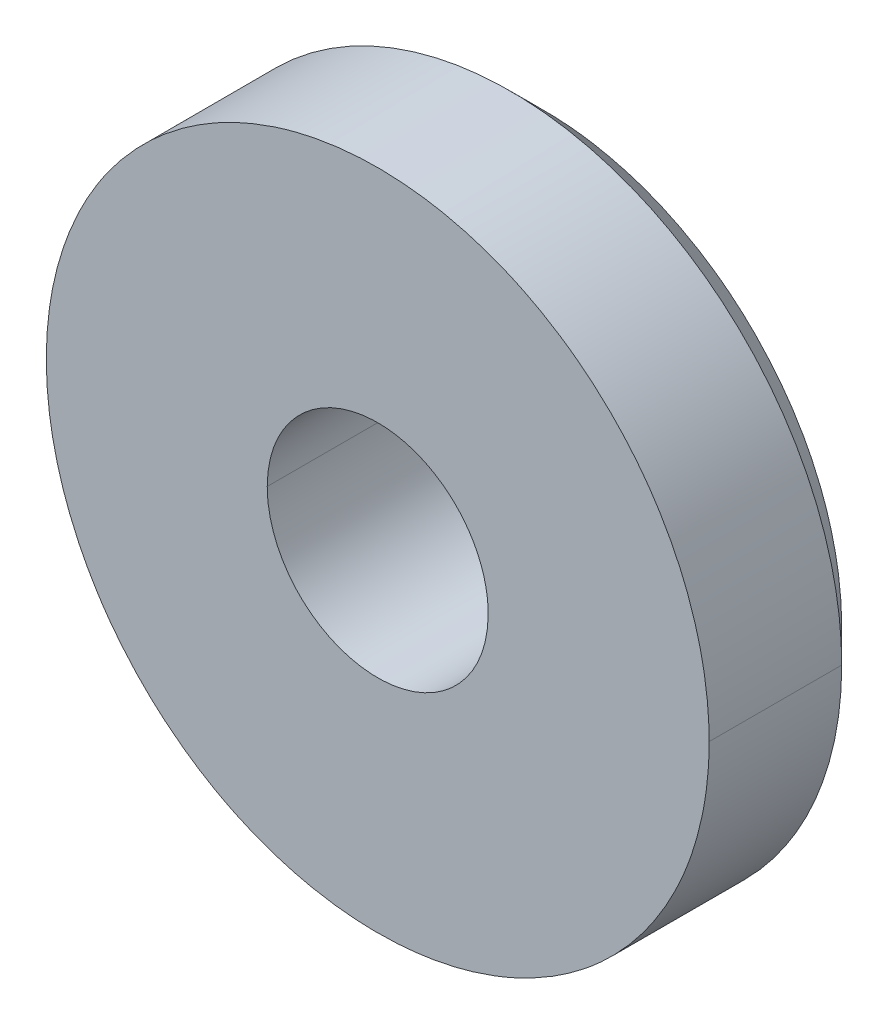
ISO-10303-21;
HEADER;
FILE_DESCRIPTION(('STEP AP214'),'2;1');
FILE_NAME('part.step','',(''),(''),'','','');
FILE_SCHEMA(('AUTOMOTIVE_DESIGN { 1 0 10303 214 1 1 1 1 }'));
ENDSEC;
DATA;
#1=APPLICATION_CONTEXT('core data for automotive mechanical design processes');
#2=APPLICATION_PROTOCOL_DEFINITION('international standard','automotive_design',2000,#1);
#3=PRODUCT_CONTEXT('',#1,'mechanical');
#4=PRODUCT('Part','Part','',(#3));
#5=PRODUCT_RELATED_PRODUCT_CATEGORY('part','',(#4));
#6=PRODUCT_DEFINITION_FORMATION('','',#4);
#7=PRODUCT_DEFINITION_CONTEXT('part definition',#1,'design');
#8=PRODUCT_DEFINITION('design','',#6,#7);
#9=PRODUCT_DEFINITION_SHAPE('','',#8);
#10=(LENGTH_UNIT() NAMED_UNIT(*) SI_UNIT(.MILLI.,.METRE.));
#11=(NAMED_UNIT(*) PLANE_ANGLE_UNIT() SI_UNIT($,.RADIAN.));
#12=(NAMED_UNIT(*) SI_UNIT($,.STERADIAN.) SOLID_ANGLE_UNIT());
#13=UNCERTAINTY_MEASURE_WITH_UNIT(LENGTH_MEASURE(1.E-05),#10,'distance_accuracy_value','');
#14=(GEOMETRIC_REPRESENTATION_CONTEXT(3) GLOBAL_UNCERTAINTY_ASSIGNED_CONTEXT((#13)) GLOBAL_UNIT_ASSIGNED_CONTEXT((#10,
#11,#12)) REPRESENTATION_CONTEXT('',''));
#15=CARTESIAN_POINT('',(0.,0.,0.));
#16=DIRECTION('',(0.,0.,1.));
#17=DIRECTION('',(1.,0.,0.));
#18=AXIS2_PLACEMENT_3D('',#15,#16,#17);
#19=CARTESIAN_POINT('',(0.741607202149,-10.1523636274,3.85520000018));
#20=CARTESIAN_POINT('',(0.741607202149,-10.1523636274,4.148));
#21=CARTESIAN_POINT('',(0.741607202149,-9.92239904514,3.85520000018));
#22=CARTESIAN_POINT('',(0.741607202149,-9.92239904514,4.148));
#23=CARTESIAN_POINT('',(0.651560219188,-9.69221990444,3.85520000018));
#24=CARTESIAN_POINT('',(0.651560219188,-9.69221990444,4.148));
#25=CARTESIAN_POINT('',(0.469536366635,-9.51041061034,3.85520000018));
#26=CARTESIAN_POINT('',(0.469536366635,-9.51041061034,4.148));
#27=CARTESIAN_POINT('',(0.0096072021492,-9.33031664442,3.85520000018));
#28=CARTESIAN_POINT('',(0.0096072021492,-9.33031664442,4.148));
#29=CARTESIAN_POINT('',(-0.450321962336,-9.51041061034,3.85520000018));
#30=CARTESIAN_POINT('',(-0.450321962336,-9.51041061034,4.148));
#31=CARTESIAN_POINT('',(-0.632345814889,-9.69221990444,3.85520000018));
#32=CARTESIAN_POINT('',(-0.632345814889,-9.69221990444,4.148));
#33=CARTESIAN_POINT('',(-0.722392797851,-9.92239904514,3.85520000018));
#34=CARTESIAN_POINT('',(-0.722392797851,-9.92239904514,4.148));
#35=CARTESIAN_POINT('',(-0.722392797851,-10.1523636274,3.85520000018));
#36=CARTESIAN_POINT('',(-0.722392797851,-10.1523636274,4.148));
#37=B_SPLINE_SURFACE_WITH_KNOTS('',5,1,((#19,#20),(#21,#22),(#23,#24),(#25,#26),(#27,#28),(#29,
#30),(#31,#32),(#33,#34),(#35,#36)),.UNSPECIFIED.,.F.,.F.,.F.,(6,3,6),(2,2),(0.,4.71238898038,
9.42477796077),(0.300000000745,1.5),.UNSPECIFIED.);
#38=DIRECTION('',(0.,0.,1.));
#39=VECTOR('',#38,1.);
#40=CARTESIAN_POINT('',(-0.722392797851,-10.1523636274,4.00160000009));
#41=LINE('',#40,#39);
#42=CARTESIAN_POINT('',(-0.722392797851,-10.1523636274,3.855200000045));
#43=VERTEX_POINT('',#42);
#44=CARTESIAN_POINT('',(-0.722392797851,-10.1523636274,4.148));
#45=VERTEX_POINT('',#44);
#46=EDGE_CURVE('E75',#43,#45,#41,.T.);
#47=CARTESIAN_POINT('',(-0.722392797851,-10.1523636274,4.148));
#48=CARTESIAN_POINT('',(-0.722432423499187,-10.1111685273464,4.148));
#49=CARTESIAN_POINT('',(-0.718927404655226,-10.0699817403168,4.148));
#50=CARTESIAN_POINT('',(-0.705079684813569,-9.98880846107538,4.148));
#51=CARTESIAN_POINT('',(-0.694742736725961,-9.9488209885561,4.148));
#52=CARTESIAN_POINT('',(-0.667485595560483,-9.87116709534559,4.148));
#53=CARTESIAN_POINT('',(-0.650567139432428,-9.83350006529359,4.148));
#54=CARTESIAN_POINT('',(-0.61065456072932,-9.76154763979671,4.148));
#55=CARTESIAN_POINT('',(-0.587661674176344,-9.72726155834494,4.148));
#56=CARTESIAN_POINT('',(-0.536248146104297,-9.66301662065583,4.148));
#57=CARTESIAN_POINT('',(-0.507825779798539,-9.63305914481557,4.148));
#58=CARTESIAN_POINT('',(-0.446363458581145,-9.57832971433559,4.148));
#59=CARTESIAN_POINT('',(-0.413323584855613,-9.55355766854354,4.148));
#60=CARTESIAN_POINT('',(-0.343476258670869,-9.50985461634751,4.148));
#61=CARTESIAN_POINT('',(-0.306660020902168,-9.49093766121748,4.148));
#62=CARTESIAN_POINT('',(-0.230396748521862,-9.45959321678437,4.148));
#63=CARTESIAN_POINT('',(-0.190952822648428,-9.44715820742077,4.148));
#64=CARTESIAN_POINT('',(-0.124005993842673,-9.43212328628082,4.148));
#65=CARTESIAN_POINT('',(-0.0969139330411425,-9.42762576465929,4.148));
#66=CARTESIAN_POINT('',(-0.0423953098154197,-9.42169455400499,4.148));
#67=CARTESIAN_POINT('',(-0.0149687283796831,-9.42026103993018,4.148));
#68=CARTESIAN_POINT('',(0.0535928354110576,-9.4205313259659,4.148));
#69=CARTESIAN_POINT('',(0.0947351449589279,-9.42415890175526,4.148));
#70=CARTESIAN_POINT('',(0.175852167422075,-9.43828501511646,4.148));
#71=CARTESIAN_POINT('',(0.215825679402244,-9.4487903771589,4.148));
#72=CARTESIAN_POINT('',(0.293357044025869,-9.47634868821114,4.148));
#73=CARTESIAN_POINT('',(0.33091975023955,-9.49338796710421,4.148));
#74=CARTESIAN_POINT('',(0.402717423279223,-9.53355667018007,4.148));
#75=CARTESIAN_POINT('',(0.436946563630724,-9.55669650441231,4.148));
#76=CARTESIAN_POINT('',(0.501057064632766,-9.60840024155609,4.148));
#77=CARTESIAN_POINT('',(0.530936193886822,-9.63696691104007,4.148));
#78=CARTESIAN_POINT('',(0.585433562374645,-9.69865535399853,4.148));
#79=CARTESIAN_POINT('',(0.610060669435483,-9.73176929162176,4.148));
#80=CARTESIAN_POINT('',(0.653472181414884,-9.80174823565215,4.148));
#81=CARTESIAN_POINT('',(0.672240773939987,-9.83862304337055,4.148));
#82=CARTESIAN_POINT('',(0.703292191130568,-9.91500170549565,4.148));
#83=CARTESIAN_POINT('',(0.715578555789208,-9.95450411165013,4.148));
#84=CARTESIAN_POINT('',(0.730157102628293,-10.0206156460551,4.148));
#85=CARTESIAN_POINT('',(0.734450708643157,-10.0468007842673,4.148));
#86=CARTESIAN_POINT('',(0.74017542949504,-10.0994416858263,4.148));
#87=CARTESIAN_POINT('',(0.741610903978342,-10.12589697504,4.148));
#88=CARTESIAN_POINT('',(0.741607202149,-10.1523636272,4.148));
#89=B_SPLINE_CURVE_WITH_KNOTS('',3,(#47,#48,#49,#50,#51,#52,#53,#54,#55,#56,#57,#58,#59,#60,#61,
#62,#63,#64,#65,#66,#67,#68,#69,#70,#71,#72,#73,#74,#75,#76,#77,#78,#79,#80,#81,#82,#83,#84,#85,
#86,#87,#88),.UNSPECIFIED.,.F.,.F.,(4,2,2,2,2,2,2,2,2,2,2,2,2,2,2,2,2,2,2,2,4),(0.,
0.123423883478034,0.246743968545604,0.370031529814897,0.493294023888686,0.616595740159022,
0.739895288782198,0.863488482376534,0.986937967800939,1.0691644334498,1.15139559418847,
1.27468367458818,1.39809427314119,1.52124807119916,1.64461339585898,1.7680417811166,
1.89126008297913,2.01480813698982,2.13828865046214,2.21774840994021,2.29708687246489),.UNSPECIFIED.);
#90=CARTESIAN_POINT('',(0.741607202149,-10.1523636273,4.148));
#91=VERTEX_POINT('',#90);
#92=EDGE_CURVE('E23',#45,#91,#89,.T.);
#93=DIRECTION('',(0.,0.,-1.));
#94=VECTOR('',#93,1.);
#95=CARTESIAN_POINT('',(0.741607202149,-10.1523636274,4.00160000009));
#96=LINE('',#95,#94);
#97=CARTESIAN_POINT('',(0.741607202149,-10.1523636274,3.855200000045));
#98=VERTEX_POINT('',#97);
#99=EDGE_CURVE('E65',#91,#98,#96,.T.);
#100=CARTESIAN_POINT('',(0.741607202149,-10.1523636274,3.8552));
#101=CARTESIAN_POINT('',(0.741607202149,-9.92239904514,3.8552));
#102=CARTESIAN_POINT('',(0.651560219188,-9.69221990444,3.8552));
#103=CARTESIAN_POINT('',(0.469536366635,-9.51041061034,3.8552));
#104=CARTESIAN_POINT('',(0.0096072021492,-9.33031664442,3.8552));
#105=CARTESIAN_POINT('',(-0.450321962336,-9.51041061034,3.8552));
#106=CARTESIAN_POINT('',(-0.632345814889,-9.69221990444,3.8552));
#107=CARTESIAN_POINT('',(-0.722392797851,-9.92239904514,3.8552));
#108=CARTESIAN_POINT('',(-0.722392797851,-10.1523636274,3.8552));
#109=B_SPLINE_CURVE_WITH_KNOTS('',5,(#100,#101,#102,#103,#104,#105,#106,#107,#108),
.UNSPECIFIED.,.F.,.F.,(6,3,6),(0.,157.079632679,314.159265359),.UNSPECIFIED.);
#110=EDGE_CURVE('E74',#43,#98,#109,.F.);
#111=ORIENTED_EDGE('',*,*,#46,.T.);
#112=ORIENTED_EDGE('',*,*,#92,.T.);
#113=ORIENTED_EDGE('',*,*,#99,.T.);
#114=ORIENTED_EDGE('',*,*,#110,.F.);
#115=EDGE_LOOP('',(#111,#112,#113,#114));
#116=FACE_BOUND('',#115,.T.);
#117=ADVANCED_FACE('F16',(#116),#37,.T.);
#118=CARTESIAN_POINT('',(0.668407202149,-10.1523636274,3.782));
#119=CARTESIAN_POINT('',(0.741607202149,-10.1523636274,3.8552));
#120=CARTESIAN_POINT('',(0.668407202149,-9.94539550336,3.782));
#121=CARTESIAN_POINT('',(0.741607202149,-9.92239904514,3.8552));
#122=CARTESIAN_POINT('',(0.587364917484,-9.73823427673,3.782));
#123=CARTESIAN_POINT('',(0.651560219188,-9.69221990444,3.8552));
#124=CARTESIAN_POINT('',(0.423543450186,-9.57460591205,3.782));
#125=CARTESIAN_POINT('',(0.469536366635,-9.51041061034,3.8552));
#126=CARTESIAN_POINT('',(0.0096072021492,-9.41252134272,3.782));
#127=CARTESIAN_POINT('',(0.0096072021492,-9.33031664442,3.8552));
#128=CARTESIAN_POINT('',(-0.404329045888,-9.57460591205,3.782));
#129=CARTESIAN_POINT('',(-0.450321962336,-9.51041061034,3.8552));
#130=CARTESIAN_POINT('',(-0.568150513185,-9.73823427673,3.782));
#131=CARTESIAN_POINT('',(-0.632345814889,-9.69221990444,3.8552));
#132=CARTESIAN_POINT('',(-0.649192797851,-9.94539550336,3.782));
#133=CARTESIAN_POINT('',(-0.722392797851,-9.92239904514,3.8552));
#134=CARTESIAN_POINT('',(-0.649192797851,-10.1523636274,3.782));
#135=CARTESIAN_POINT('',(-0.722392797851,-10.1523636274,3.8552));
#136=B_SPLINE_SURFACE_WITH_KNOTS('',5,1,((#118,#119),(#120,#121),(#122,#123),(#124,#125),(#126,
#127),(#128,#129),(#130,#131),(#132,#133),(#134,#135)),.UNSPECIFIED.,.F.,.F.,.F.,(6,3,6),(2,2),
(0.,157.079632679,314.159265359),(-0.212132034356,0.212132034356),.UNSPECIFIED.);
#137=DIRECTION('',(0.707106781186549,0.,0.707106781186546));
#138=VECTOR('',#137,1.);
#139=CARTESIAN_POINT('',(0.705007202149,-10.1523636274,3.8186));
#140=LINE('',#139,#138);
#141=CARTESIAN_POINT('',(0.668407202149,-10.1523636274,3.782));
#142=VERTEX_POINT('',#141);
#143=EDGE_CURVE('E237',#142,#98,#140,.T.);
#144=CARTESIAN_POINT('',(0.668407202149,-10.1523636274,3.782));
#145=CARTESIAN_POINT('',(0.6684428900144,-10.1152761522206,3.782));
#146=CARTESIAN_POINT('',(0.665286344951107,-10.0781962178984,3.782));
#147=CARTESIAN_POINT('',(0.652815499437408,-10.0051177990971,3.782));
#148=CARTESIAN_POINT('',(0.643506408814306,-9.96911842656298,3.782));
#149=CARTESIAN_POINT('',(0.618950019794749,-9.89918284358384,3.782));
#150=CARTESIAN_POINT('',(0.603699593911601,-9.86524773064894,3.782));
#151=CARTESIAN_POINT('',(0.567718635541626,-9.80042790785306,3.782));
#152=CARTESIAN_POINT('',(0.546988976881086,-9.76954271267004,3.782));
#153=CARTESIAN_POINT('',(0.500662658260428,-9.71171255247884,3.782));
#154=CARTESIAN_POINT('',(0.475070226714507,-9.68476419994388,3.782));
#155=CARTESIAN_POINT('',(0.419730800218386,-9.63553425981047,3.782));
#156=CARTESIAN_POINT('',(0.389983561505038,-9.61325294621974,3.782));
#157=CARTESIAN_POINT('',(0.327115637227163,-9.57396068374474,3.782));
#158=CARTESIAN_POINT('',(0.293988985513177,-9.55695927786246,3.782));
#159=CARTESIAN_POINT('',(0.225348239578179,-9.5287771022224,3.782));
#160=CARTESIAN_POINT('',(0.189834337528331,-9.51759586457921,3.782));
#161=CARTESIAN_POINT('',(0.117521048217636,-9.50139728561173,3.782));
#162=CARTESIAN_POINT('',(0.0807250580271895,-9.49636476570743,3.782));
#163=CARTESIAN_POINT('',(0.006812015063087,-9.49253102618693,3.782));
#164=CARTESIAN_POINT('',(-0.0303050243898824,-9.4937295492643,3.782));
#165=CARTESIAN_POINT('',(-0.103869372253559,-9.50234183068112,3.782));
#166=CARTESIAN_POINT('',(-0.14031557984277,-9.50976501018872,3.782));
#167=CARTESIAN_POINT('',(-0.211436929676845,-9.53063977631524,3.782));
#168=CARTESIAN_POINT('',(-0.246112150375978,-9.54409109563061,3.782));
#169=CARTESIAN_POINT('',(-0.312647128715574,-9.57659944642767,3.782));
#170=CARTESIAN_POINT('',(-0.344511919334176,-9.5956461811299,3.782));
#171=CARTESIAN_POINT('',(-0.404601883771334,-9.63880639533054,3.782));
#172=CARTESIAN_POINT('',(-0.432827039915595,-9.66291989943201,3.782));
#173=CARTESIAN_POINT('',(-0.484904830484827,-9.71559104672248,3.782));
#174=CARTESIAN_POINT('',(-0.508747189032719,-9.74415885100378,3.782));
#175=CARTESIAN_POINT('',(-0.551296794487451,-9.80489218834482,3.782));
#176=CARTESIAN_POINT('',(-0.570004158242076,-9.83705763951597,3.782));
#177=CARTESIAN_POINT('',(-0.601754982220326,-9.90409728348879,3.782));
#178=CARTESIAN_POINT('',(-0.614794606903192,-9.93897329185449,3.782));
#179=CARTESIAN_POINT('',(-0.634790555582025,-10.0103797204443,3.782));
#180=CARTESIAN_POINT('',(-0.641756108745536,-10.0469075416919,3.782));
#181=CARTESIAN_POINT('',(-0.648004671157885,-10.1065411375124,3.782));
#182=CARTESIAN_POINT('',(-0.649203518673693,-10.1294588083198,3.782));
#183=CARTESIAN_POINT('',(-0.649192797851,-10.1523636274,3.782));
#184=B_SPLINE_CURVE_WITH_KNOTS('',3,(#144,#145,#146,#147,#148,#149,#150,#151,#152,#153,#154,
#155,#156,#157,#158,#159,#160,#161,#162,#163,#164,#165,#166,#167,#168,#169,#170,#171,#172,#173,
#174,#175,#176,#177,#178,#179,#180,#181,#182,#183),.UNSPECIFIED.,.F.,.F.,(4,2,2,2,2,2,2,2,2,2,2,
2,2,2,2,2,2,2,2,4),(0.,0.111116908860868,0.222139846945482,0.33322130604029,0.444285060577122,
0.555252678194433,0.666226809035167,0.777400364653236,0.888564981608372,0.999454622118593,
1.11033968355752,1.22139287577614,1.33244114409194,1.44328632605838,1.55413204627575,
1.66523442908698,1.77633428353271,1.88750920619556,1.99851490977315,2.06723138042201),.UNSPECIFIED.);
#185=CARTESIAN_POINT('',(-0.649192797851,-10.1523636274,3.782));
#186=VERTEX_POINT('',#185);
#187=EDGE_CURVE('E153',#142,#186,#184,.T.);
#188=DIRECTION('',(0.707106781186548,0.,-0.707106781186547));
#189=VECTOR('',#188,1.);
#190=CARTESIAN_POINT('',(-0.685792797851,-10.1523636274,3.8186));
#191=LINE('',#190,#189);
#192=EDGE_CURVE('E235',#43,#186,#191,.T.);
#193=ORIENTED_EDGE('',*,*,#143,.F.);
#194=ORIENTED_EDGE('',*,*,#187,.T.);
#195=ORIENTED_EDGE('',*,*,#192,.F.);
#196=ORIENTED_EDGE('',*,*,#110,.T.);
#197=EDGE_LOOP('',(#193,#194,#195,#196));
#198=FACE_BOUND('',#197,.T.);
#199=ADVANCED_FACE('F162',(#198),#136,.T.);
#200=CARTESIAN_POINT('',(-0.649192797851,-10.1523636274,3.782));
#201=CARTESIAN_POINT('',(-0.722392797851,-10.1523636274,3.8552));
#202=CARTESIAN_POINT('',(-0.649192797851,-10.3593317514,3.782));
#203=CARTESIAN_POINT('',(-0.722392797851,-10.3823282096,3.8552));
#204=CARTESIAN_POINT('',(-0.568150513185,-10.566492978,3.782));
#205=CARTESIAN_POINT('',(-0.63234581489,-10.6125073503,3.8552));
#206=CARTESIAN_POINT('',(-0.404329045888,-10.7301213427,3.782));
#207=CARTESIAN_POINT('',(-0.450321962337,-10.7943166444,3.8552));
#208=CARTESIAN_POINT('',(0.0096072021492,-10.892205912,3.782));
#209=CARTESIAN_POINT('',(0.0096072021492,-10.9744106103,3.8552));
#210=CARTESIAN_POINT('',(0.423543450186,-10.7301213427,3.782));
#211=CARTESIAN_POINT('',(0.469536366635,-10.7943166444,3.8552));
#212=CARTESIAN_POINT('',(0.587364917484,-10.566492978,3.782));
#213=CARTESIAN_POINT('',(0.651560219188,-10.6125073503,3.8552));
#214=CARTESIAN_POINT('',(0.668407202149,-10.3593317514,3.782));
#215=CARTESIAN_POINT('',(0.741607202149,-10.3823282096,3.8552));
#216=CARTESIAN_POINT('',(0.668407202149,-10.1523636274,3.782));
#217=CARTESIAN_POINT('',(0.741607202149,-10.1523636274,3.8552));
#218=B_SPLINE_SURFACE_WITH_KNOTS('',5,1,((#200,#201),(#202,#203),(#204,#205),(#206,#207),(#208,
#209),(#210,#211),(#212,#213),(#214,#215),(#216,#217)),.UNSPECIFIED.,.F.,.F.,.F.,(6,3,6),(2,2),
(314.159265359,471.238898038,628.318530718),(-0.212132034358,0.212132034358),.UNSPECIFIED.);
#219=CARTESIAN_POINT('',(-0.649192797851,-10.1523636274,3.782));
#220=CARTESIAN_POINT('',(-0.6492284857164,-10.1894511025667,3.782));
#221=CARTESIAN_POINT('',(-0.646071940653986,-10.2265310368761,3.782));
#222=CARTESIAN_POINT('',(-0.63360109514461,-10.2996094556519,3.782));
#223=CARTESIAN_POINT('',(-0.624292004525008,-10.3356088281733,3.782));
#224=CARTESIAN_POINT('',(-0.599735615515911,-10.405544411128,3.782));
#225=CARTESIAN_POINT('',(-0.584485189639767,-10.4394795240513,3.782));
#226=CARTESIAN_POINT('',(-0.548504231287397,-10.5042993468265,3.782));
#227=CARTESIAN_POINT('',(-0.527774572637429,-10.5351845420005,3.782));
#228=CARTESIAN_POINT('',(-0.481448254033629,-10.5930147021865,3.782));
#229=CARTESIAN_POINT('',(-0.455855822492433,-10.6199630547241,3.782));
#230=CARTESIAN_POINT('',(-0.400516396005512,-10.6691929948637,3.782));
#231=CARTESIAN_POINT('',(-0.370769157296638,-10.6914743084582,3.782));
#232=CARTESIAN_POINT('',(-0.307901233025173,-10.7307665709426,3.782));
#233=CARTESIAN_POINT('',(-0.274774581312919,-10.7477679768303,3.782));
#234=CARTESIAN_POINT('',(-0.206133835380323,-10.7759501524812,3.782));
#235=CARTESIAN_POINT('',(-0.170619933331146,-10.7871313901297,3.782));
#236=CARTESIAN_POINT('',(-0.0983066440226275,-10.8033299691072,3.782));
#237=CARTESIAN_POINT('',(-0.0615106538337555,-10.8083624890166,3.782));
#238=CARTESIAN_POINT('',(0.0124023891280993,-10.8121962285484,3.782));
#239=CARTESIAN_POINT('',(0.0495194285803958,-10.8109977054773,3.782));
#240=CARTESIAN_POINT('',(0.123083776448448,-10.8023854240733,3.782));
#241=CARTESIAN_POINT('',(0.159529984042621,-10.7949622445714,3.782));
#242=CARTESIAN_POINT('',(0.230651333887172,-10.7740874784546,3.782));
#243=CARTESIAN_POINT('',(0.265326554591821,-10.7606361591433,3.782));
#244=CARTESIAN_POINT('',(0.331861532939316,-10.7281278083544,3.782));
#245=CARTESIAN_POINT('',(0.363726323560573,-10.7090810736567,3.782));
#246=CARTESIAN_POINT('',(0.423816288003856,-10.6659208594648,3.782));
#247=CARTESIAN_POINT('',(0.452041444151581,-10.6418073553675,3.782));
#248=CARTESIAN_POINT('',(0.504119234728751,-10.5891362080845,3.782));
#249=CARTESIAN_POINT('',(0.527961593281087,-10.5605684038067,3.782));
#250=CARTESIAN_POINT('',(0.570511198745282,-10.4998350664717,3.782));
#251=CARTESIAN_POINT('',(0.589218562504928,-10.4676696153032,3.782));
#252=CARTESIAN_POINT('',(0.620969386493298,-10.4006299713345,3.782));
#253=CARTESIAN_POINT('',(0.634009011181236,-10.3657539629702,3.782));
#254=CARTESIAN_POINT('',(0.654004959869073,-10.2943475343822,3.782));
#255=CARTESIAN_POINT('',(0.66097051303653,-10.2578197131348,3.782));
#256=CARTESIAN_POINT('',(0.66721907545451,-10.1981861173056,3.782));
#257=CARTESIAN_POINT('',(0.668417922971729,-10.1752684464892,3.782));
#258=CARTESIAN_POINT('',(0.668407202149,-10.1523636274,3.782));
#259=B_SPLINE_CURVE_WITH_KNOTS('',3,(#219,#220,#221,#222,#223,#224,#225,#226,#227,#228,#229,
#230,#231,#232,#233,#234,#235,#236,#237,#238,#239,#240,#241,#242,#243,#244,#245,#246,#247,#248,
#249,#250,#251,#252,#253,#254,#255,#256,#257,#258),.UNSPECIFIED.,.F.,.F.,(4,2,2,2,2,2,2,2,2,2,2,
2,2,2,2,2,2,2,2,4),(0.,0.111116908822671,0.222139846868064,0.333221305922811,0.444285060420128,
0.555252678033383,0.666226808870091,0.777400364490926,0.88856498144886,0.999454621956558,
1.11033968339307,1.22139287562271,1.33244114394932,1.44328632591551,1.5541320461328,
1.66523442894472,1.77633428339107,1.88750920605511,1.99851490963368,2.06723138030945),.UNSPECIFIED.);
#260=EDGE_CURVE('E158',#186,#142,#259,.T.);
#261=CARTESIAN_POINT('',(-0.722392797851,-10.1523636274,3.8552));
#262=CARTESIAN_POINT('',(-0.722392797851,-10.3823282096,3.8552));
#263=CARTESIAN_POINT('',(-0.632345814889,-10.6125073503,3.8552));
#264=CARTESIAN_POINT('',(-0.450321962336,-10.7943166444,3.8552));
#265=CARTESIAN_POINT('',(0.0096072021492,-10.9744106103,3.8552));
#266=CARTESIAN_POINT('',(0.469536366635,-10.7943166444,3.8552));
#267=CARTESIAN_POINT('',(0.651560219188,-10.6125073503,3.8552));
#268=CARTESIAN_POINT('',(0.741607202149,-10.3823282096,3.8552));
#269=CARTESIAN_POINT('',(0.741607202149,-10.1523636274,3.8552));
#270=B_SPLINE_CURVE_WITH_KNOTS('',5,(#261,#262,#263,#264,#265,#266,#267,#268,#269),
.UNSPECIFIED.,.F.,.F.,(6,3,6),(9.42477796077,14.1371669412,18.8495559215),.UNSPECIFIED.);
#271=EDGE_CURVE('E152',#43,#98,#270,.T.);
#272=ORIENTED_EDGE('',*,*,#192,.T.);
#273=ORIENTED_EDGE('',*,*,#260,.T.);
#274=ORIENTED_EDGE('',*,*,#143,.T.);
#275=ORIENTED_EDGE('',*,*,#271,.F.);
#276=EDGE_LOOP('',(#272,#273,#274,#275));
#277=FACE_BOUND('',#276,.T.);
#278=ADVANCED_FACE('F125',(#277),#218,.T.);
#279=CARTESIAN_POINT('',(0.0096072021492,-10.1523636274,3.782));
#280=DIRECTION('',(0.,0.,1.));
#281=DIRECTION('',(1.,0.,0.));
#282=AXIS2_PLACEMENT_3D('',#279,#280,#281);
#283=PLANE('',#282);
#284=CARTESIAN_POINT('',(-0.234392797851,-10.1523636274,3.782));
#285=CARTESIAN_POINT('',(-0.234404818173571,-10.1660826772365,3.782));
#286=CARTESIAN_POINT('',(-0.233239339639963,-10.1797979364527,3.782));
#287=CARTESIAN_POINT('',(-0.228633515229728,-10.2068294472002,3.782));
#288=CARTESIAN_POINT('',(-0.225195091379917,-10.2201460259237,3.782));
#289=CARTESIAN_POINT('',(-0.216120883490512,-10.246019984594,3.782));
#290=CARTESIAN_POINT('',(-0.210483948433885,-10.2585769628725,3.782));
#291=CARTESIAN_POINT('',(-0.197198425807195,-10.2825572970578,3.782));
#292=CARTESIAN_POINT('',(-0.189550149006834,-10.2939808277169,3.782));
#293=CARTESIAN_POINT('',(-0.163872380158643,-10.3260635730651,3.782));
#294=CARTESIAN_POINT('',(-0.143079757185359,-10.3446189243436,3.782));
#295=CARTESIAN_POINT('',(-0.0965226206246826,-10.3737890269783,3.782));
#296=CARTESIAN_POINT('',(-0.0707494099594805,-10.3843897274935,3.782));
#297=CARTESIAN_POINT('',(-0.0172040678570755,-10.39643450593,3.782));
#298=CARTESIAN_POINT('',(0.0105629089831653,-10.3979013929482,3.782));
#299=CARTESIAN_POINT('',(0.0650589685371467,-10.3915602534089,3.782));
#300=CARTESIAN_POINT('',(0.0917865036111241,-10.3837389053361,3.782));
#301=CARTESIAN_POINT('',(0.141088002272458,-10.3597176992785,3.782));
#302=CARTESIAN_POINT('',(0.163669406146645,-10.343533052504,3.782));
#303=CARTESIAN_POINT('',(0.202284901419748,-10.3045174570626,3.782));
#304=CARTESIAN_POINT('',(0.218303941107985,-10.2816714325862,3.782));
#305=CARTESIAN_POINT('',(0.235969897737646,-10.2445001083651,3.782));
#306=CARTESIAN_POINT('',(0.240801538592202,-10.2315956584392,3.782));
#307=CARTESIAN_POINT('',(0.248223610434106,-10.2051615848252,3.782));
#308=CARTESIAN_POINT('',(0.250817421221885,-10.1916329365386,3.782));
#309=CARTESIAN_POINT('',(0.253160605008341,-10.1694757843138,3.782));
#310=CARTESIAN_POINT('',(0.253612615151696,-10.1609164570815,3.782));
#311=CARTESIAN_POINT('',(0.253607202149,-10.1523636274,3.782));
#312=B_SPLINE_CURVE_WITH_KNOTS('',3,(#284,#285,#286,#287,#288,#289,#290,#291,#292,#293,#294,
#295,#296,#297,#298,#299,#300,#301,#302,#303,#304,#305,#306,#307,#308,#309,#310,#311),
.UNSPECIFIED.,.F.,.F.,(4,2,2,2,2,2,2,2,2,2,2,2,2,4),(0.,0.0411014434346829,0.0821681754340445,
0.123256436592064,0.164338352984389,0.246247380900141,0.328300751923305,0.41014913557992,
0.492115050998115,0.573932408394625,0.655936388732152,0.697112382825044,0.738226079296899,
0.763888788657895),.UNSPECIFIED.);
#313=CARTESIAN_POINT('',(-0.234392797851,-10.1523636274,3.782));
#314=VERTEX_POINT('',#313);
#315=CARTESIAN_POINT('',(0.253607202149,-10.1523636274,3.782));
#316=VERTEX_POINT('',#315);
#317=EDGE_CURVE('E114',#314,#316,#312,.T.);
#318=ORIENTED_EDGE('',*,*,#317,.T.);
#319=CARTESIAN_POINT('',(0.253607202149,-10.1523636274,3.782));
#320=CARTESIAN_POINT('',(0.253620348432797,-10.1386453411514,3.782));
#321=CARTESIAN_POINT('',(0.252454321276193,-10.1249298285559,3.782));
#322=CARTESIAN_POINT('',(0.24784740015788,-10.0978976358251,3.782));
#323=CARTESIAN_POINT('',(0.244408399867827,-10.0845806333263,3.782));
#324=CARTESIAN_POINT('',(0.235336301911154,-10.0587076313771,3.782));
#325=CARTESIAN_POINT('',(0.229702015194198,-10.0461520486068,3.782));
#326=CARTESIAN_POINT('',(0.216408518027754,-10.0221670280875,3.782));
#327=CARTESIAN_POINT('',(0.208749719179347,-10.0107373620773,3.782));
#328=CARTESIAN_POINT('',(0.191621501843117,-9.98931779670637,3.782));
#329=CARTESIAN_POINT('',(0.182151258540456,-9.97932855687075,3.782));
#330=CARTESIAN_POINT('',(0.161671363792343,-9.9610775797699,3.782));
#331=CARTESIAN_POINT('',(0.150661681580409,-9.95281587703864,3.782));
#332=CARTESIAN_POINT('',(0.127382783343702,-9.9382390107584,3.782));
#333=CARTESIAN_POINT('',(0.115110627956925,-9.93192853340824,3.782));
#334=CARTESIAN_POINT('',(0.0896997043433044,-9.921470757973,3.782));
#335=CARTESIAN_POINT('',(0.0765619898212095,-9.91732088251574,3.782));
#336=CARTESIAN_POINT('',(0.0456064888081569,-9.91036212515174,3.782));
#337=CARTESIAN_POINT('',(0.0275982216368124,-9.90836527337839,3.782));
#338=CARTESIAN_POINT('',(-0.00410437479013409,-9.90836237290781,3.782));
#339=CARTESIAN_POINT('',(-0.0178059334292525,-9.90952003175731,3.782));
#340=CARTESIAN_POINT('',(-0.0448295356925524,-9.91411200168259,3.782));
#341=CARTESIAN_POINT('',(-0.0581511756254226,-9.91754864674667,3.782));
#342=CARTESIAN_POINT('',(-0.0969199701924114,-9.93116162971716,3.782));
#343=CARTESIAN_POINT('',(-0.121287578409838,-9.94464187129275,3.782));
#344=CARTESIAN_POINT('',(-0.164176833095447,-9.97893626260838,3.782));
#345=CARTESIAN_POINT('',(-0.182695419311471,-9.99975423949406,3.782));
#346=CARTESIAN_POINT('',(-0.204534482577032,-10.0346033019207,3.782));
#347=CARTESIAN_POINT('',(-0.210833233563323,-10.0468612250348,3.782));
#348=CARTESIAN_POINT('',(-0.221284159795876,-10.0722720346448,3.782));
#349=CARTESIAN_POINT('',(-0.225437443710653,-10.0854244549254,3.782));
#350=CARTESIAN_POINT('',(-0.230428016292071,-10.1076087345612,3.782));
#351=CARTESIAN_POINT('',(-0.231914583553043,-10.1165010244564,3.782));
#352=CARTESIAN_POINT('',(-0.233896696994784,-10.1343820541024,3.782));
#353=CARTESIAN_POINT('',(-0.234393709529392,-10.1433706312689,3.782));
#354=CARTESIAN_POINT('',(-0.234392797851,-10.1523636274,3.782));
#355=B_SPLINE_CURVE_WITH_KNOTS('',3,(#319,#320,#321,#322,#323,#324,#325,#326,#327,#328,#329,
#330,#331,#332,#333,#334,#335,#336,#337,#338,#339,#340,#341,#342,#343,#344,#345,#346,#347,#348,
#349,#350,#351,#352,#353,#354),.UNSPECIFIED.,.F.,.F.,(4,2,2,2,2,2,2,2,2,2,2,2,2,2,2,2,2,4),(0.,
0.0411011873993961,0.0821681754459282,0.123257437920544,0.164338353004114,0.205438018405169,
0.246538505321694,0.28773694877787,0.328886133540817,0.382765464955392,0.42382876315478,
0.464934180774154,0.546812467520246,0.628733522906184,0.669916143591482,0.711077461845963,
0.73807396310787,0.765030430228378),.UNSPECIFIED.);
#356=EDGE_CURVE('E146',#316,#314,#355,.T.);
#357=ORIENTED_EDGE('',*,*,#356,.T.);
#358=EDGE_LOOP('',(#318,#357));
#359=FACE_BOUND('',#358,.T.);
#360=ORIENTED_EDGE('',*,*,#260,.F.);
#361=ORIENTED_EDGE('',*,*,#187,.F.);
#362=EDGE_LOOP('',(#360,#361));
#363=FACE_BOUND('',#362,.T.);
#364=ADVANCED_FACE('F104',(#359,#363),#283,.F.);
#365=CARTESIAN_POINT('',(-0.722392797851,-10.1523636274,3.8552));
#366=CARTESIAN_POINT('',(-0.722392797851,-10.1523636274,4.148));
#367=CARTESIAN_POINT('',(-0.722392797851,-10.3823282096,3.8552));
#368=CARTESIAN_POINT('',(-0.722392797851,-10.3823282096,4.148));
#369=CARTESIAN_POINT('',(-0.632345814889,-10.6125073503,3.8552));
#370=CARTESIAN_POINT('',(-0.632345814889,-10.6125073503,4.148));
#371=CARTESIAN_POINT('',(-0.450321962336,-10.7943166444,3.8552));
#372=CARTESIAN_POINT('',(-0.450321962336,-10.7943166444,4.148));
#373=CARTESIAN_POINT('',(0.0096072021492,-10.9744106103,3.8552));
#374=CARTESIAN_POINT('',(0.0096072021492,-10.9744106103,4.148));
#375=CARTESIAN_POINT('',(0.469536366635,-10.7943166444,3.8552));
#376=CARTESIAN_POINT('',(0.469536366635,-10.7943166444,4.148));
#377=CARTESIAN_POINT('',(0.651560219188,-10.6125073503,3.8552));
#378=CARTESIAN_POINT('',(0.651560219188,-10.6125073503,4.148));
#379=CARTESIAN_POINT('',(0.741607202149,-10.3823282096,3.8552));
#380=CARTESIAN_POINT('',(0.741607202149,-10.3823282096,4.148));
#381=CARTESIAN_POINT('',(0.741607202149,-10.1523636274,3.8552));
#382=CARTESIAN_POINT('',(0.741607202149,-10.1523636274,4.148));
#383=B_SPLINE_SURFACE_WITH_KNOTS('',5,1,((#365,#366),(#367,#368),(#369,#370),(#371,#372),(#373,
#374),(#375,#376),(#377,#378),(#379,#380),(#381,#382)),.UNSPECIFIED.,.F.,.F.,.F.,(6,3,6),(2,2),
(9.42477796077,14.1371669412,18.8495559215),(0.3,1.5),.UNSPECIFIED.);
#384=CARTESIAN_POINT('',(-0.722392797851,-10.1523636274,4.148));
#385=CARTESIAN_POINT('',(-0.722432419095972,-10.1935589674152,4.148));
#386=CARTESIAN_POINT('',(-0.718927361515591,-10.2347459947466,4.148));
#387=CARTESIAN_POINT('',(-0.70507956669804,-10.315919261077,4.148));
#388=CARTESIAN_POINT('',(-0.694742661911052,-10.355906493944,4.148));
#389=CARTESIAN_POINT('',(-0.667485911204127,-10.4335592455679,4.148));
#390=CARTESIAN_POINT('',(-0.650567918559859,-10.4712254144948,4.148));
#391=CARTESIAN_POINT('',(-0.610655663628707,-10.543177996818,4.148));
#392=CARTESIAN_POINT('',(-0.587662351743172,-10.5774649376977,4.148));
#393=CARTESIAN_POINT('',(-0.536249074829132,-10.6417093855853,4.148));
#394=CARTESIAN_POINT('',(-0.507827723689117,-10.6716657832993,4.148));
#395=CARTESIAN_POINT('',(-0.446366323776897,-10.7263955846757,4.148));
#396=CARTESIAN_POINT('',(-0.413325996197714,-10.7511686752419,4.148));
#397=CARTESIAN_POINT('',(-0.343494117160429,-10.79486086555,4.148));
#398=CARTESIAN_POINT('',(-0.306695919303965,-10.8137693458048,4.148));
#399=CARTESIAN_POINT('',(-0.230443675916002,-10.8451202324195,4.148));
#400=CARTESIAN_POINT('',(-0.190989845882956,-10.8575631627312,4.148));
#401=CARTESIAN_POINT('',(-0.110650397382968,-10.8756009446718,4.148));
#402=CARTESIAN_POINT('',(-0.069768557698911,-10.8812126416567,4.148));
#403=CARTESIAN_POINT('',(0.012355241144378,-10.8855124166953,4.148));
#404=CARTESIAN_POINT('',(0.053597185417938,-10.8842007795993,4.148));
#405=CARTESIAN_POINT('',(0.135340070735728,-10.8746714113465,4.148));
#406=CARTESIAN_POINT('',(0.175839798202883,-10.8664432499831,4.148));
#407=CARTESIAN_POINT('',(0.254874678592873,-10.8432877397954,4.148));
#408=CARTESIAN_POINT('',(0.293409919054256,-10.8283606897681,4.148));
#409=CARTESIAN_POINT('',(0.367355234372813,-10.7922764662437,4.148));
#410=CARTESIAN_POINT('',(0.402770887960266,-10.7711307201234,4.148));
#411=CARTESIAN_POINT('',(0.469560950556054,-10.7232074115889,4.148));
#412=CARTESIAN_POINT('',(0.500935338229421,-10.6964298194446,4.148));
#413=CARTESIAN_POINT('',(0.558828373080699,-10.6379343170751,4.148));
#414=CARTESIAN_POINT('',(0.58533554815048,-10.6062050529268,4.148));
#415=CARTESIAN_POINT('',(0.632645756384138,-10.5387460401246,4.148));
#416=CARTESIAN_POINT('',(0.653449107639433,-10.5030165147142,4.148));
#417=CARTESIAN_POINT('',(0.688762859931832,-10.4285487617078,4.148));
#418=CARTESIAN_POINT('',(0.703268863338987,-10.3898084537783,4.148));
#419=CARTESIAN_POINT('',(0.725529568892602,-10.3104683022685,4.148));
#420=CARTESIAN_POINT('',(0.733294479201041,-10.2698713687036,4.148));
#421=CARTESIAN_POINT('',(0.738934174806173,-10.216232314903,4.148));
#422=CARTESIAN_POINT('',(0.739937355141449,-10.2034678357853,4.148));
#423=CARTESIAN_POINT('',(0.741272941404343,-10.1779251573271,4.148));
#424=CARTESIAN_POINT('',(0.741606463570301,-10.1651470164006,4.148));
#425=CARTESIAN_POINT('',(0.741607202149,-10.1523636272,4.14800000000001));
#426=B_SPLINE_CURVE_WITH_KNOTS('',3,(#384,#385,#386,#387,#388,#389,#390,#391,#392,#393,#394,
#395,#396,#397,#398,#399,#400,#401,#402,#403,#404,#405,#406,#407,#408,#409,#410,#411,#412,#413,
#414,#415,#416,#417,#418,#419,#420,#421,#422,#423,#424,#425),.UNSPECIFIED.,.F.,.F.,(4,2,2,2,2,2,
2,2,2,2,2,2,2,2,2,2,2,2,2,2,4),(0.,0.123424601008976,0.246743968461197,0.370028633515958,
0.493294023762912,0.61659093341772,0.739895288638457,0.863421633997909,0.986937967534637,
1.11014909715765,1.23335515747999,1.3567473481202,1.48013403552628,1.60329539134718,
1.72645739734456,1.84990607298269,1.97334786272177,2.09687571749813,2.22021618382513,
2.25861553574155,2.29695082731534),.UNSPECIFIED.);
#427=EDGE_CURVE('E71',#45,#91,#426,.T.);
#428=ORIENTED_EDGE('',*,*,#99,.F.);
#429=ORIENTED_EDGE('',*,*,#427,.F.);
#430=ORIENTED_EDGE('',*,*,#46,.F.);
#431=ORIENTED_EDGE('',*,*,#271,.T.);
#432=EDGE_LOOP('',(#428,#429,#430,#431));
#433=FACE_BOUND('',#432,.T.);
#434=ADVANCED_FACE('F77',(#433),#383,.T.);
#435=CARTESIAN_POINT('',(0.253607202149,-10.1523636274,3.782));
#436=CARTESIAN_POINT('',(0.253607202149,-10.1523636274,4.148));
#437=CARTESIAN_POINT('',(0.253607202149,-10.0757087666,3.782));
#438=CARTESIAN_POINT('',(0.253607202149,-10.0757087666,4.148));
#439=CARTESIAN_POINT('',(0.223591541162,-9.9989823864,3.782));
#440=CARTESIAN_POINT('',(0.223591541162,-9.9989823864,4.148));
#441=CARTESIAN_POINT('',(0.162916923644,-9.93837928837,3.782));
#442=CARTESIAN_POINT('',(0.162916923644,-9.93837928837,4.148));
#443=CARTESIAN_POINT('',(0.0096072021492,-9.87834796639,3.782));
#444=CARTESIAN_POINT('',(0.0096072021492,-9.87834796639,4.148));
#445=CARTESIAN_POINT('',(-0.143702519346,-9.93837928837,3.782));
#446=CARTESIAN_POINT('',(-0.143702519346,-9.93837928837,4.148));
#447=CARTESIAN_POINT('',(-0.204377136864,-9.9989823864,3.782));
#448=CARTESIAN_POINT('',(-0.204377136864,-9.9989823864,4.148));
#449=CARTESIAN_POINT('',(-0.234392797851,-10.0757087666,3.782));
#450=CARTESIAN_POINT('',(-0.234392797851,-10.0757087666,4.148));
#451=CARTESIAN_POINT('',(-0.234392797851,-10.1523636274,3.782));
#452=CARTESIAN_POINT('',(-0.234392797851,-10.1523636274,4.148));
#453=B_SPLINE_SURFACE_WITH_KNOTS('',5,1,((#435,#436),(#437,#438),(#439,#440),(#441,#442),(#443,
#444),(#445,#446),(#447,#448),(#449,#450),(#451,#452)),.UNSPECIFIED.,.F.,.F.,.F.,(6,3,6),(2,2),
(0.,1.57079632679,3.14159265359),(0.,1.5),.UNSPECIFIED.);
#454=DIRECTION('',(0.,0.,1.));
#455=VECTOR('',#454,1.);
#456=CARTESIAN_POINT('',(0.253607202149,-10.1523636274,3.965));
#457=LINE('',#456,#455);
#458=CARTESIAN_POINT('',(0.253607202149,-10.15236362738,4.148));
#459=VERTEX_POINT('',#458);
#460=EDGE_CURVE('E79',#316,#459,#457,.T.);
#461=CARTESIAN_POINT('',(-0.234392797851,-10.1523636274,4.148));
#462=CARTESIAN_POINT('',(-0.234405944134795,-10.1386453411514,4.148));
#463=CARTESIAN_POINT('',(-0.233239916978195,-10.124929828556,4.148));
#464=CARTESIAN_POINT('',(-0.228632995859893,-10.0978976358251,4.148));
#465=CARTESIAN_POINT('',(-0.225193995569847,-10.0845806333264,4.148));
#466=CARTESIAN_POINT('',(-0.216121897613189,-10.0587076313773,4.148));
#467=CARTESIAN_POINT('',(-0.21048761089624,-10.046152048607,4.148));
#468=CARTESIAN_POINT('',(-0.197194113729812,-10.0221670280877,4.148));
#469=CARTESIAN_POINT('',(-0.189535314881412,-10.0107373620775,4.148));
#470=CARTESIAN_POINT('',(-0.172407097545209,-9.98931779670658,4.148));
#471=CARTESIAN_POINT('',(-0.16293685424257,-9.97932855687098,4.148));
#472=CARTESIAN_POINT('',(-0.142456959494504,-9.96107757977017,4.148));
#473=CARTESIAN_POINT('',(-0.131447277282597,-9.95281587703892,4.148));
#474=CARTESIAN_POINT('',(-0.108168379045922,-9.93823901075869,4.148));
#475=CARTESIAN_POINT('',(-0.0958962236591481,-9.93192853340851,4.148));
#476=CARTESIAN_POINT('',(-0.0704853000455379,-9.92147075797323,4.148));
#477=CARTESIAN_POINT('',(-0.0573475855234501,-9.91732088251594,4.148));
#478=CARTESIAN_POINT('',(-0.0263920845101987,-9.91036212515181,4.148));
#479=CARTESIAN_POINT('',(-0.00838381733863527,-9.9083652733784,4.148));
#480=CARTESIAN_POINT('',(0.023318779088464,-9.9083623729078,4.148));
#481=CARTESIAN_POINT('',(0.0370203377275167,-9.90952003175729,4.148));
#482=CARTESIAN_POINT('',(0.0640439399906898,-9.91411200168252,4.148));
#483=CARTESIAN_POINT('',(0.077365579923499,-9.91754864674656,4.148));
#484=CARTESIAN_POINT('',(0.11613437449031,-9.93116162971695,4.148));
#485=CARTESIAN_POINT('',(0.140501982707622,-9.94464187129248,4.148));
#486=CARTESIAN_POINT('',(0.183391237393066,-9.9789362626079,4.148));
#487=CARTESIAN_POINT('',(0.201909823609038,-9.99975423949346,4.148));
#488=CARTESIAN_POINT('',(0.223748886874645,-10.03460330192,4.148));
#489=CARTESIAN_POINT('',(0.230047637860982,-10.046861225034,4.148));
#490=CARTESIAN_POINT('',(0.240498564093621,-10.072272034644,4.148));
#491=CARTESIAN_POINT('',(0.24465184800844,-10.0854244549247,4.148));
#492=CARTESIAN_POINT('',(0.249642420588494,-10.107608734554,4.148));
#493=CARTESIAN_POINT('',(0.251128987848772,-10.1165010244427,4.148));
#494=CARTESIAN_POINT('',(0.253111101290564,-10.1343820540755,4.148));
#495=CARTESIAN_POINT('',(0.253608113825916,-10.1433706312354,4.148));
#496=CARTESIAN_POINT('',(0.253607202149,-10.15236362736,4.148));
#497=B_SPLINE_CURVE_WITH_KNOTS('',3,(#461,#462,#463,#464,#465,#466,#467,#468,#469,#470,#471,
#472,#473,#474,#475,#476,#477,#478,#479,#480,#481,#482,#483,#484,#485,#486,#487,#488,#489,#490,
#491,#492,#493,#494,#495,#496),.UNSPECIFIED.,.F.,.F.,(4,2,2,2,2,2,2,2,2,2,2,2,2,2,2,2,2,4),(0.,
0.0411011873993471,0.0821681754458322,0.123257437920396,0.164338353003915,0.20543801840488,
0.246538505321314,0.287736948777499,0.328886133540457,0.382765464955687,0.423828763154877,
0.464934180774049,0.546812467519747,0.628733522905325,0.66991614359069,0.71107746184519,
0.738073963087527,0.765030430188449),.UNSPECIFIED.);
#498=CARTESIAN_POINT('',(-0.234392797851,-10.1523636274,4.148));
#499=VERTEX_POINT('',#498);
#500=EDGE_CURVE('E34',#499,#459,#497,.T.);
#501=DIRECTION('',(0.,0.,-1.));
#502=VECTOR('',#501,1.);
#503=CARTESIAN_POINT('',(-0.234392797851,-10.1523636274,3.965));
#504=LINE('',#503,#502);
#505=EDGE_CURVE('E151',#499,#314,#504,.T.);
#506=ORIENTED_EDGE('',*,*,#356,.F.);
#507=ORIENTED_EDGE('',*,*,#460,.T.);
#508=ORIENTED_EDGE('',*,*,#500,.F.);
#509=ORIENTED_EDGE('',*,*,#505,.T.);
#510=EDGE_LOOP('',(#506,#507,#508,#509));
#511=FACE_BOUND('',#510,.T.);
#512=ADVANCED_FACE('F124',(#511),#453,.F.);
#513=CARTESIAN_POINT('',(-0.234392797851,-10.1523636274,3.782));
#514=CARTESIAN_POINT('',(-0.234392797851,-10.1523636274,4.148));
#515=CARTESIAN_POINT('',(-0.234392797851,-10.2290184881,3.782));
#516=CARTESIAN_POINT('',(-0.234392797851,-10.2290184881,4.148));
#517=CARTESIAN_POINT('',(-0.204377136864,-10.3057448684,3.782));
#518=CARTESIAN_POINT('',(-0.204377136864,-10.3057448684,4.148));
#519=CARTESIAN_POINT('',(-0.143702519346,-10.3663479664,3.782));
#520=CARTESIAN_POINT('',(-0.143702519346,-10.3663479664,4.148));
#521=CARTESIAN_POINT('',(0.0096072021492,-10.4263792884,3.782));
#522=CARTESIAN_POINT('',(0.0096072021492,-10.4263792884,4.148));
#523=CARTESIAN_POINT('',(0.162916923644,-10.3663479664,3.782));
#524=CARTESIAN_POINT('',(0.162916923644,-10.3663479664,4.148));
#525=CARTESIAN_POINT('',(0.223591541162,-10.3057448684,3.782));
#526=CARTESIAN_POINT('',(0.223591541162,-10.3057448684,4.148));
#527=CARTESIAN_POINT('',(0.253607202149,-10.2290184881,3.782));
#528=CARTESIAN_POINT('',(0.253607202149,-10.2290184881,4.148));
#529=CARTESIAN_POINT('',(0.253607202149,-10.1523636274,3.782));
#530=CARTESIAN_POINT('',(0.253607202149,-10.1523636274,4.148));
#531=B_SPLINE_SURFACE_WITH_KNOTS('',5,1,((#513,#514),(#515,#516),(#517,#518),(#519,#520),(#521,
#522),(#523,#524),(#525,#526),(#527,#528),(#529,#530)),.UNSPECIFIED.,.F.,.F.,.F.,(6,3,6),(2,2),
(3.14159265359,4.71238898038,6.28318530718),(0.,1.5),.UNSPECIFIED.);
#532=CARTESIAN_POINT('',(0.253607202149,-10.15236362736,4.148));
#533=CARTESIAN_POINT('',(0.253619222473829,-10.1660826772008,4.148));
#534=CARTESIAN_POINT('',(0.252453743941735,-10.1797979364214,4.148));
#535=CARTESIAN_POINT('',(0.247847919533071,-10.2068294471779,4.148));
#536=CARTESIAN_POINT('',(0.244409495683319,-10.2201460259058,4.148));
#537=CARTESIAN_POINT('',(0.235335287792473,-10.2460199845852,4.148));
#538=CARTESIAN_POINT('',(0.229698352734283,-10.2585769628681,4.148));
#539=CARTESIAN_POINT('',(0.216412830103091,-10.2825572970616,4.148));
#540=CARTESIAN_POINT('',(0.208764553299794,-10.2939808277244,4.148));
#541=CARTESIAN_POINT('',(0.183086784446879,-10.3260635730748,4.148));
#542=CARTESIAN_POINT('',(0.162294161472577,-10.3446189243521,4.148));
#543=CARTESIAN_POINT('',(0.115737024910286,-10.3737890269842,4.148));
#544=CARTESIAN_POINT('',(0.0899638142444821,-10.384389727498,4.148));
#545=CARTESIAN_POINT('',(0.0364184721413658,-10.3964345059315,4.148));
#546=CARTESIAN_POINT('',(0.00865149530101168,-10.3979013929481,4.148));
#547=CARTESIAN_POINT('',(-0.0458445642526653,-10.3915602534058,4.148));
#548=CARTESIAN_POINT('',(-0.0725720993262248,-10.3837389053315,4.148));
#549=CARTESIAN_POINT('',(-0.121873597986175,-10.3597176992711,4.148));
#550=CARTESIAN_POINT('',(-0.144455001859407,-10.3435330524953,4.148));
#551=CARTESIAN_POINT('',(-0.183070497130278,-10.3045174570519,4.148));
#552=CARTESIAN_POINT('',(-0.199089536817227,-10.2816714325745,4.148));
#553=CARTESIAN_POINT('',(-0.216755493444801,-10.2445001083524,4.148));
#554=CARTESIAN_POINT('',(-0.221587134298633,-10.2315956584263,4.148));
#555=CARTESIAN_POINT('',(-0.229009206139057,-10.2051615848119,4.148));
#556=CARTESIAN_POINT('',(-0.231603016926079,-10.1916329365252,4.148));
#557=CARTESIAN_POINT('',(-0.233946200710816,-10.1694757843047,4.148));
#558=CARTESIAN_POINT('',(-0.234398210853689,-10.160916457077,4.148));
#559=CARTESIAN_POINT('',(-0.234392797851,-10.1523636274,4.148));
#560=B_SPLINE_CURVE_WITH_KNOTS('',3,(#532,#533,#534,#535,#536,#537,#538,#539,#540,#541,#542,
#543,#544,#545,#546,#547,#548,#549,#550,#551,#552,#553,#554,#555,#556,#557,#558,#559),
.UNSPECIFIED.,.F.,.F.,(4,2,2,2,2,2,2,2,2,2,2,2,2,4),(0.,0.0411014434474626,0.0821681754595996,
0.123256436631616,0.16433835303788,0.246247380953574,0.328300751976757,0.410149135633467,
0.492115051051721,0.573932408448089,0.655936388785592,0.697112382878498,0.738226079350343,
0.763888788697727),.UNSPECIFIED.);
#561=EDGE_CURVE('E11',#459,#499,#560,.T.);
#562=ORIENTED_EDGE('',*,*,#317,.F.);
#563=ORIENTED_EDGE('',*,*,#505,.F.);
#564=ORIENTED_EDGE('',*,*,#561,.F.);
#565=ORIENTED_EDGE('',*,*,#460,.F.);
#566=EDGE_LOOP('',(#562,#563,#564,#565));
#567=FACE_BOUND('',#566,.T.);
#568=ADVANCED_FACE('F18',(#567),#531,.F.);
#569=CARTESIAN_POINT('',(0.0096072021492,-10.1523636274,4.148));
#570=DIRECTION('',(0.,0.,1.));
#571=DIRECTION('',(1.,0.,0.));
#572=AXIS2_PLACEMENT_3D('',#569,#570,#571);
#573=PLANE('',#572);
#574=ORIENTED_EDGE('',*,*,#500,.T.);
#575=ORIENTED_EDGE('',*,*,#561,.T.);
#576=EDGE_LOOP('',(#574,#575));
#577=FACE_BOUND('',#576,.T.);
#578=ORIENTED_EDGE('',*,*,#427,.T.);
#579=ORIENTED_EDGE('',*,*,#92,.F.);
#580=EDGE_LOOP('',(#578,#579));
#581=FACE_BOUND('',#580,.T.);
#582=ADVANCED_FACE('F70',(#577,#581),#573,.T.);
#583=CLOSED_SHELL('',(#117,#199,#278,#364,#434,#512,#568,#582));
#584=MANIFOLD_SOLID_BREP('B1',#583);
#585=ADVANCED_BREP_SHAPE_REPRESENTATION('',(#18,#584),#14);
#586=SHAPE_DEFINITION_REPRESENTATION(#9,#585);
ENDSEC;
END-ISO-10303-21;
